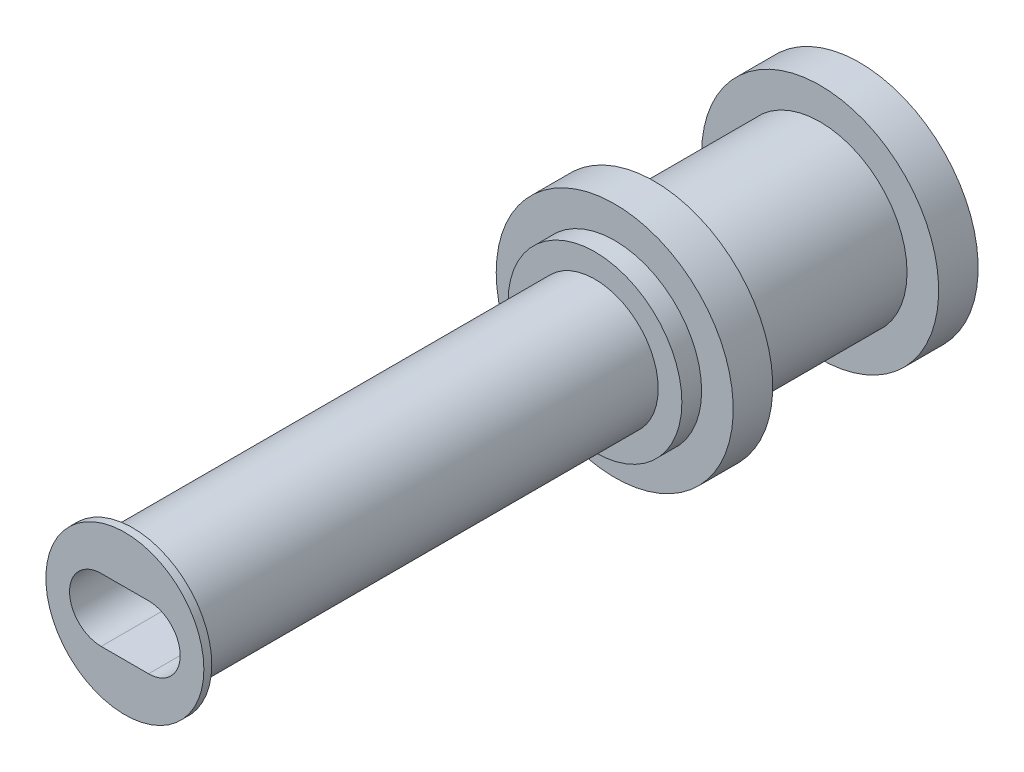
ISO-10303-21;
HEADER;
FILE_DESCRIPTION(('STEP AP214'),'2;1');
FILE_NAME('part.step','',(''),(''),'','','');
FILE_SCHEMA(('AUTOMOTIVE_DESIGN { 1 0 10303 214 1 1 1 1 }'));
ENDSEC;
DATA;
#1=APPLICATION_CONTEXT('core data for automotive mechanical design processes');
#2=APPLICATION_PROTOCOL_DEFINITION('international standard','automotive_design',2000,#1);
#3=PRODUCT_CONTEXT('',#1,'mechanical');
#4=PRODUCT('Part','Part','',(#3));
#5=PRODUCT_RELATED_PRODUCT_CATEGORY('part','',(#4));
#6=PRODUCT_DEFINITION_FORMATION('','',#4);
#7=PRODUCT_DEFINITION_CONTEXT('part definition',#1,'design');
#8=PRODUCT_DEFINITION('design','',#6,#7);
#9=PRODUCT_DEFINITION_SHAPE('','',#8);
#10=(LENGTH_UNIT() NAMED_UNIT(*) SI_UNIT(.MILLI.,.METRE.));
#11=(NAMED_UNIT(*) PLANE_ANGLE_UNIT() SI_UNIT($,.RADIAN.));
#12=(NAMED_UNIT(*) SI_UNIT($,.STERADIAN.) SOLID_ANGLE_UNIT());
#13=UNCERTAINTY_MEASURE_WITH_UNIT(LENGTH_MEASURE(1.E-05),#10,'distance_accuracy_value','');
#14=(GEOMETRIC_REPRESENTATION_CONTEXT(3) GLOBAL_UNCERTAINTY_ASSIGNED_CONTEXT((#13)) GLOBAL_UNIT_ASSIGNED_CONTEXT((#10,
#11,#12)) REPRESENTATION_CONTEXT('',''));
#15=CARTESIAN_POINT('',(0.,0.,0.));
#16=DIRECTION('',(0.,0.,1.));
#17=DIRECTION('',(1.,0.,0.));
#18=AXIS2_PLACEMENT_3D('',#15,#16,#17);
#19=CARTESIAN_POINT('',(7.874,0.,23.622));
#20=DIRECTION('',(0.,0.,-1.));
#21=DIRECTION('',(-1.,0.,0.));
#22=AXIS2_PLACEMENT_3D('',#19,#20,#21);
#23=CYLINDRICAL_SURFACE('',#22,2.032);
#24=CARTESIAN_POINT('',(7.874,0.,8.509));
#25=DIRECTION('',(0.,0.,1.));
#26=DIRECTION('',(1.,0.,0.));
#27=AXIS2_PLACEMENT_3D('',#24,#25,#26);
#28=CIRCLE('',#27,2.032);
#29=CARTESIAN_POINT('',(9.906,0.,8.509));
#30=VERTEX_POINT('',#29);
#31=EDGE_CURVE('E192',#30,#30,#28,.T.);
#32=ORIENTED_EDGE('',*,*,#31,.T.);
#33=EDGE_LOOP('',(#32));
#34=FACE_BOUND('',#33,.T.);
#35=CARTESIAN_POINT('',(7.874,0.,23.368));
#36=DIRECTION('',(0.,0.,1.));
#37=DIRECTION('',(1.,0.,0.));
#38=AXIS2_PLACEMENT_3D('',#35,#36,#37);
#39=CIRCLE('',#38,2.032);
#40=CARTESIAN_POINT('',(9.906,0.,23.368));
#41=VERTEX_POINT('',#40);
#42=EDGE_CURVE('E11',#41,#41,#39,.T.);
#43=ORIENTED_EDGE('',*,*,#42,.F.);
#44=EDGE_LOOP('',(#43));
#45=FACE_BOUND('',#44,.T.);
#46=ADVANCED_FACE('F36',(#34,#45),#23,.T.);
#47=CARTESIAN_POINT('',(7.874,0.,8.509));
#48=DIRECTION('',(0.,0.,1.));
#49=DIRECTION('',(1.,0.,0.));
#50=AXIS2_PLACEMENT_3D('',#47,#48,#49);
#51=PLANE('',#50);
#52=CARTESIAN_POINT('',(7.874,0.,8.509));
#53=DIRECTION('',(0.,0.,1.));
#54=DIRECTION('',(1.,0.,0.));
#55=AXIS2_PLACEMENT_3D('',#52,#53,#54);
#56=CIRCLE('',#55,2.794);
#57=CARTESIAN_POINT('',(10.668,0.,8.509));
#58=VERTEX_POINT('',#57);
#59=EDGE_CURVE('E197',#58,#58,#56,.T.);
#60=ORIENTED_EDGE('',*,*,#59,.T.);
#61=EDGE_LOOP('',(#60));
#62=FACE_BOUND('',#61,.T.);
#63=ORIENTED_EDGE('',*,*,#31,.F.);
#64=EDGE_LOOP('',(#63));
#65=FACE_BOUND('',#64,.T.);
#66=ADVANCED_FACE('F303',(#62,#65),#51,.T.);
#67=CARTESIAN_POINT('',(7.874,-6.28822135623731,7.874));
#68=DIRECTION('',(0.,0.,-1.));
#69=DIRECTION('',(1.,0.,0.));
#70=AXIS2_PLACEMENT_3D('',#67,#68,#69);
#71=PLANE('',#70);
#72=CARTESIAN_POINT('',(7.874,0.,7.874));
#73=DIRECTION('',(0.,0.,-1.));
#74=DIRECTION('',(-1.,0.,0.));
#75=AXIS2_PLACEMENT_3D('',#72,#73,#74);
#76=CIRCLE('',#75,3.81);
#77=CARTESIAN_POINT('',(4.064,0.,7.874));
#78=VERTEX_POINT('',#77);
#79=EDGE_CURVE('E200',#78,#78,#76,.T.);
#80=ORIENTED_EDGE('',*,*,#79,.F.);
#81=EDGE_LOOP('',(#80));
#82=FACE_BOUND('',#81,.T.);
#83=CARTESIAN_POINT('',(7.874,0.,7.874));
#84=DIRECTION('',(0.,0.,-1.));
#85=DIRECTION('',(-1.,0.,0.));
#86=AXIS2_PLACEMENT_3D('',#83,#84,#85);
#87=CIRCLE('',#86,2.794);
#88=CARTESIAN_POINT('',(5.08,0.,7.874));
#89=VERTEX_POINT('',#88);
#90=EDGE_CURVE('E44',#89,#89,#87,.F.);
#91=ORIENTED_EDGE('',*,*,#90,.F.);
#92=EDGE_LOOP('',(#91));
#93=FACE_BOUND('',#92,.T.);
#94=ADVANCED_FACE('F301',(#82,#93),#71,.F.);
#95=CARTESIAN_POINT('',(7.874,0.,3.937));
#96=DIRECTION('',(0.,0.,-1.));
#97=DIRECTION('',(-1.,0.,0.));
#98=AXIS2_PLACEMENT_3D('',#95,#96,#97);
#99=CYLINDRICAL_SURFACE('',#98,2.794);
#100=CARTESIAN_POINT('',(7.874,0.,1.27));
#101=DIRECTION('',(0.,0.,-1.));
#102=DIRECTION('',(-1.,0.,0.));
#103=AXIS2_PLACEMENT_3D('',#100,#101,#102);
#104=CIRCLE('',#103,2.794);
#105=CARTESIAN_POINT('',(5.08,0.,1.27));
#106=VERTEX_POINT('',#105);
#107=EDGE_CURVE('E291',#106,#106,#104,.T.);
#108=ORIENTED_EDGE('',*,*,#107,.F.);
#109=EDGE_LOOP('',(#108));
#110=FACE_BOUND('',#109,.T.);
#111=CARTESIAN_POINT('',(7.874,0.,6.604));
#112=DIRECTION('',(0.,0.,1.));
#113=DIRECTION('',(1.,0.,0.));
#114=AXIS2_PLACEMENT_3D('',#111,#112,#113);
#115=CIRCLE('',#114,2.794);
#116=CARTESIAN_POINT('',(10.668,0.,6.604));
#117=VERTEX_POINT('',#116);
#118=EDGE_CURVE('E294',#117,#117,#115,.T.);
#119=ORIENTED_EDGE('',*,*,#118,.F.);
#120=EDGE_LOOP('',(#119));
#121=FACE_BOUND('',#120,.T.);
#122=ADVANCED_FACE('F38',(#110,#121),#99,.T.);
#123=CARTESIAN_POINT('',(7.874,-1.524,3.937));
#124=DIRECTION('',(0.,0.,-1.));
#125=DIRECTION('',(-1.,0.,0.));
#126=AXIS2_PLACEMENT_3D('',#123,#124,#125);
#127=CYLINDRICAL_SURFACE('',#126,0.762000000000002);
#128=CARTESIAN_POINT('',(7.874,-1.524,0.));
#129=DIRECTION('',(0.,0.,1.));
#130=DIRECTION('',(1.,0.,0.));
#131=AXIS2_PLACEMENT_3D('',#128,#129,#130);
#132=CIRCLE('',#131,0.762000000000002);
#133=CARTESIAN_POINT('',(7.112,-1.524,0.));
#134=VERTEX_POINT('',#133);
#135=CARTESIAN_POINT('',(8.636,-1.524,0.));
#136=VERTEX_POINT('',#135);
#137=EDGE_CURVE('E236',#134,#136,#132,.T.);
#138=ORIENTED_EDGE('',*,*,#137,.F.);
#139=DIRECTION('',(0.,0.,-1.));
#140=VECTOR('',#139,1.);
#141=CARTESIAN_POINT('',(7.112,-1.524,3.937));
#142=LINE('',#141,#140);
#143=CARTESIAN_POINT('',(7.112,-1.524,7.874));
#144=VERTEX_POINT('',#143);
#145=EDGE_CURVE('E289',#144,#134,#142,.T.);
#146=ORIENTED_EDGE('',*,*,#145,.F.);
#147=CARTESIAN_POINT('',(7.874,-1.524,7.874));
#148=DIRECTION('',(0.,0.,1.));
#149=DIRECTION('',(1.,0.,0.));
#150=AXIS2_PLACEMENT_3D('',#147,#148,#149);
#151=CIRCLE('',#150,0.762000000000002);
#152=CARTESIAN_POINT('',(8.636,-1.524,7.874));
#153=VERTEX_POINT('',#152);
#154=EDGE_CURVE('E204',#144,#153,#151,.T.);
#155=ORIENTED_EDGE('',*,*,#154,.T.);
#156=DIRECTION('',(0.,0.,-1.));
#157=VECTOR('',#156,1.);
#158=CARTESIAN_POINT('',(8.636,-1.524,3.937));
#159=LINE('',#158,#157);
#160=EDGE_CURVE('E59',#153,#136,#159,.T.);
#161=ORIENTED_EDGE('',*,*,#160,.T.);
#162=EDGE_LOOP('',(#138,#146,#155,#161));
#163=FACE_BOUND('',#162,.T.);
#164=ADVANCED_FACE('F310',(#163),#127,.F.);
#165=CARTESIAN_POINT('',(7.112,-6.28822135623731,3.937));
#166=DIRECTION('',(1.,0.,0.));
#167=DIRECTION('',(0.,0.,-1.));
#168=AXIS2_PLACEMENT_3D('',#165,#166,#167);
#169=PLANE('',#168);
#170=DIRECTION('',(0.,-1.,0.));
#171=VECTOR('',#170,1.);
#172=CARTESIAN_POINT('',(7.112,-6.28822135623731,0.));
#173=LINE('',#172,#171);
#174=CARTESIAN_POINT('',(7.112,-0.762000000000001,0.));
#175=VERTEX_POINT('',#174);
#176=EDGE_CURVE('E242',#175,#134,#173,.T.);
#177=ORIENTED_EDGE('',*,*,#176,.F.);
#178=DIRECTION('',(0.,0.,-1.));
#179=VECTOR('',#178,1.);
#180=CARTESIAN_POINT('',(7.112,-0.762000000000001,3.937));
#181=LINE('',#180,#179);
#182=CARTESIAN_POINT('',(7.112,-0.762000000000001,7.874));
#183=VERTEX_POINT('',#182);
#184=EDGE_CURVE('E287',#183,#175,#181,.T.);
#185=ORIENTED_EDGE('',*,*,#184,.F.);
#186=DIRECTION('',(0.,-1.,0.));
#187=VECTOR('',#186,1.);
#188=CARTESIAN_POINT('',(7.112,-6.28822135623731,7.874));
#189=LINE('',#188,#187);
#190=EDGE_CURVE('E229',#183,#144,#189,.T.);
#191=ORIENTED_EDGE('',*,*,#190,.T.);
#192=ORIENTED_EDGE('',*,*,#145,.T.);
#193=EDGE_LOOP('',(#177,#185,#191,#192));
#194=FACE_BOUND('',#193,.T.);
#195=ADVANCED_FACE('F466',(#194),#169,.T.);
#196=CARTESIAN_POINT('',(7.874,-0.762000000000001,3.937));
#197=DIRECTION('',(0.,1.,0.));
#198=DIRECTION('',(-1.,0.,0.));
#199=AXIS2_PLACEMENT_3D('',#196,#197,#198);
#200=PLANE('',#199);
#201=DIRECTION('',(1.,0.,0.));
#202=VECTOR('',#201,1.);
#203=CARTESIAN_POINT('',(7.874,-0.762000000000001,0.));
#204=LINE('',#203,#202);
#205=CARTESIAN_POINT('',(6.35,-0.762000000000002,0.));
#206=VERTEX_POINT('',#205);
#207=EDGE_CURVE('E245',#206,#175,#204,.T.);
#208=ORIENTED_EDGE('',*,*,#207,.F.);
#209=DIRECTION('',(0.,0.,-1.));
#210=VECTOR('',#209,1.);
#211=CARTESIAN_POINT('',(6.35,-0.762000000000002,3.937));
#212=LINE('',#211,#210);
#213=CARTESIAN_POINT('',(6.35,-0.762000000000002,7.874));
#214=VERTEX_POINT('',#213);
#215=EDGE_CURVE('E285',#214,#206,#212,.T.);
#216=ORIENTED_EDGE('',*,*,#215,.F.);
#217=DIRECTION('',(1.,0.,0.));
#218=VECTOR('',#217,1.);
#219=CARTESIAN_POINT('',(7.874,-0.762000000000001,7.874));
#220=LINE('',#219,#218);
#221=EDGE_CURVE('E216',#214,#183,#220,.T.);
#222=ORIENTED_EDGE('',*,*,#221,.T.);
#223=ORIENTED_EDGE('',*,*,#184,.T.);
#224=EDGE_LOOP('',(#208,#216,#222,#223));
#225=FACE_BOUND('',#224,.T.);
#226=ADVANCED_FACE('F476',(#225),#200,.T.);
#227=CARTESIAN_POINT('',(6.35,0.,3.937));
#228=DIRECTION('',(0.,0.,-1.));
#229=DIRECTION('',(-1.,0.,0.));
#230=AXIS2_PLACEMENT_3D('',#227,#228,#229);
#231=CYLINDRICAL_SURFACE('',#230,0.762000000000002);
#232=CARTESIAN_POINT('',(6.35,0.,0.));
#233=DIRECTION('',(0.,0.,1.));
#234=DIRECTION('',(1.,0.,0.));
#235=AXIS2_PLACEMENT_3D('',#232,#233,#234);
#236=CIRCLE('',#235,0.762000000000002);
#237=CARTESIAN_POINT('',(6.35,0.762000000000001,0.));
#238=VERTEX_POINT('',#237);
#239=EDGE_CURVE('E249',#238,#206,#236,.T.);
#240=ORIENTED_EDGE('',*,*,#239,.F.);
#241=DIRECTION('',(0.,0.,-1.));
#242=VECTOR('',#241,1.);
#243=CARTESIAN_POINT('',(6.35,0.762000000000001,3.937));
#244=LINE('',#243,#242);
#245=CARTESIAN_POINT('',(6.35,0.762000000000001,7.874));
#246=VERTEX_POINT('',#245);
#247=EDGE_CURVE('E283',#246,#238,#244,.T.);
#248=ORIENTED_EDGE('',*,*,#247,.F.);
#249=CARTESIAN_POINT('',(6.35,0.,7.874));
#250=DIRECTION('',(0.,0.,1.));
#251=DIRECTION('',(1.,0.,0.));
#252=AXIS2_PLACEMENT_3D('',#249,#250,#251);
#253=CIRCLE('',#252,0.762000000000002);
#254=EDGE_CURVE('E230',#246,#214,#253,.T.);
#255=ORIENTED_EDGE('',*,*,#254,.T.);
#256=ORIENTED_EDGE('',*,*,#215,.T.);
#257=EDGE_LOOP('',(#240,#248,#255,#256));
#258=FACE_BOUND('',#257,.T.);
#259=ADVANCED_FACE('F488',(#258),#231,.F.);
#260=CARTESIAN_POINT('',(7.874,0.762000000000001,3.937));
#261=DIRECTION('',(0.,1.,0.));
#262=DIRECTION('',(-1.,0.,0.));
#263=AXIS2_PLACEMENT_3D('',#260,#261,#262);
#264=PLANE('',#263);
#265=DIRECTION('',(1.,0.,0.));
#266=VECTOR('',#265,1.);
#267=CARTESIAN_POINT('',(7.874,0.762000000000001,0.));
#268=LINE('',#267,#266);
#269=CARTESIAN_POINT('',(7.112,0.762000000000001,0.));
#270=VERTEX_POINT('',#269);
#271=EDGE_CURVE('E253',#238,#270,#268,.T.);
#272=ORIENTED_EDGE('',*,*,#271,.T.);
#273=DIRECTION('',(0.,0.,-1.));
#274=VECTOR('',#273,1.);
#275=CARTESIAN_POINT('',(7.112,0.762000000000001,3.937));
#276=LINE('',#275,#274);
#277=CARTESIAN_POINT('',(7.112,0.762000000000001,7.874));
#278=VERTEX_POINT('',#277);
#279=EDGE_CURVE('E281',#278,#270,#276,.T.);
#280=ORIENTED_EDGE('',*,*,#279,.F.);
#281=DIRECTION('',(1.,0.,0.));
#282=VECTOR('',#281,1.);
#283=CARTESIAN_POINT('',(7.874,0.762000000000001,7.874));
#284=LINE('',#283,#282);
#285=EDGE_CURVE('E222',#246,#278,#284,.T.);
#286=ORIENTED_EDGE('',*,*,#285,.F.);
#287=ORIENTED_EDGE('',*,*,#247,.T.);
#288=EDGE_LOOP('',(#272,#280,#286,#287));
#289=FACE_BOUND('',#288,.T.);
#290=ADVANCED_FACE('F500',(#289),#264,.F.);
#291=CARTESIAN_POINT('',(7.112,1.524,0.));
#292=VERTEX_POINT('',#291);
#293=EDGE_CURVE('E246',#292,#270,#173,.T.);
#294=ORIENTED_EDGE('',*,*,#293,.F.);
#295=DIRECTION('',(0.,0.,-1.));
#296=VECTOR('',#295,1.);
#297=CARTESIAN_POINT('',(7.112,1.524,3.937));
#298=LINE('',#297,#296);
#299=CARTESIAN_POINT('',(7.112,1.524,7.874));
#300=VERTEX_POINT('',#299);
#301=EDGE_CURVE('E279',#300,#292,#298,.T.);
#302=ORIENTED_EDGE('',*,*,#301,.F.);
#303=EDGE_CURVE('E226',#300,#278,#189,.T.);
#304=ORIENTED_EDGE('',*,*,#303,.T.);
#305=ORIENTED_EDGE('',*,*,#279,.T.);
#306=EDGE_LOOP('',(#294,#302,#304,#305));
#307=FACE_BOUND('',#306,.T.);
#308=ADVANCED_FACE('F479',(#307),#169,.T.);
#309=CARTESIAN_POINT('',(7.874,1.524,3.937));
#310=DIRECTION('',(0.,0.,-1.));
#311=DIRECTION('',(-1.,0.,0.));
#312=AXIS2_PLACEMENT_3D('',#309,#310,#311);
#313=CYLINDRICAL_SURFACE('',#312,0.762000000000002);
#314=CARTESIAN_POINT('',(7.874,1.524,0.));
#315=DIRECTION('',(0.,0.,1.));
#316=DIRECTION('',(1.,0.,0.));
#317=AXIS2_PLACEMENT_3D('',#314,#315,#316);
#318=CIRCLE('',#317,0.762000000000002);
#319=CARTESIAN_POINT('',(8.636,1.524,0.));
#320=VERTEX_POINT('',#319);
#321=EDGE_CURVE('E257',#320,#292,#318,.T.);
#322=ORIENTED_EDGE('',*,*,#321,.F.);
#323=DIRECTION('',(0.,0.,-1.));
#324=VECTOR('',#323,1.);
#325=CARTESIAN_POINT('',(8.636,1.524,3.937));
#326=LINE('',#325,#324);
#327=CARTESIAN_POINT('',(8.636,1.524,7.874));
#328=VERTEX_POINT('',#327);
#329=EDGE_CURVE('E277',#328,#320,#326,.T.);
#330=ORIENTED_EDGE('',*,*,#329,.F.);
#331=CARTESIAN_POINT('',(7.874,1.524,7.874));
#332=DIRECTION('',(0.,0.,1.));
#333=DIRECTION('',(1.,0.,0.));
#334=AXIS2_PLACEMENT_3D('',#331,#332,#333);
#335=CIRCLE('',#334,0.762000000000002);
#336=EDGE_CURVE('E223',#328,#300,#335,.T.);
#337=ORIENTED_EDGE('',*,*,#336,.T.);
#338=ORIENTED_EDGE('',*,*,#301,.T.);
#339=EDGE_LOOP('',(#322,#330,#337,#338));
#340=FACE_BOUND('',#339,.T.);
#341=ADVANCED_FACE('F522',(#340),#313,.F.);
#342=CARTESIAN_POINT('',(8.636,-6.28822135623731,3.937));
#343=DIRECTION('',(1.,0.,0.));
#344=DIRECTION('',(0.,0.,-1.));
#345=AXIS2_PLACEMENT_3D('',#342,#343,#344);
#346=PLANE('',#345);
#347=DIRECTION('',(0.,-1.,0.));
#348=VECTOR('',#347,1.);
#349=CARTESIAN_POINT('',(8.636,-6.28822135623731,0.));
#350=LINE('',#349,#348);
#351=CARTESIAN_POINT('',(8.636,0.762000000000001,0.));
#352=VERTEX_POINT('',#351);
#353=EDGE_CURVE('E260',#320,#352,#350,.T.);
#354=ORIENTED_EDGE('',*,*,#353,.T.);
#355=DIRECTION('',(0.,0.,-1.));
#356=VECTOR('',#355,1.);
#357=CARTESIAN_POINT('',(8.636,0.762000000000001,3.937));
#358=LINE('',#357,#356);
#359=CARTESIAN_POINT('',(8.636,0.762000000000001,7.874));
#360=VERTEX_POINT('',#359);
#361=EDGE_CURVE('E274',#360,#352,#358,.T.);
#362=ORIENTED_EDGE('',*,*,#361,.F.);
#363=DIRECTION('',(0.,-1.,0.));
#364=VECTOR('',#363,1.);
#365=CARTESIAN_POINT('',(8.636,-6.28822135623731,7.874));
#366=LINE('',#365,#364);
#367=EDGE_CURVE('E212',#328,#360,#366,.T.);
#368=ORIENTED_EDGE('',*,*,#367,.F.);
#369=ORIENTED_EDGE('',*,*,#329,.T.);
#370=EDGE_LOOP('',(#354,#362,#368,#369));
#371=FACE_BOUND('',#370,.T.);
#372=ADVANCED_FACE('F532',(#371),#346,.F.);
#373=CARTESIAN_POINT('',(9.398,0.762000000000002,0.));
#374=VERTEX_POINT('',#373);
#375=EDGE_CURVE('E256',#352,#374,#268,.T.);
#376=ORIENTED_EDGE('',*,*,#375,.T.);
#377=DIRECTION('',(0.,0.,-1.));
#378=VECTOR('',#377,1.);
#379=CARTESIAN_POINT('',(9.398,0.762000000000002,3.937));
#380=LINE('',#379,#378);
#381=CARTESIAN_POINT('',(9.398,0.762000000000002,7.874));
#382=VERTEX_POINT('',#381);
#383=EDGE_CURVE('E272',#382,#374,#380,.T.);
#384=ORIENTED_EDGE('',*,*,#383,.F.);
#385=EDGE_CURVE('E219',#360,#382,#284,.T.);
#386=ORIENTED_EDGE('',*,*,#385,.F.);
#387=ORIENTED_EDGE('',*,*,#361,.T.);
#388=EDGE_LOOP('',(#376,#384,#386,#387));
#389=FACE_BOUND('',#388,.T.);
#390=ADVANCED_FACE('F513',(#389),#264,.F.);
#391=CARTESIAN_POINT('',(9.398,0.,3.937));
#392=DIRECTION('',(0.,0.,-1.));
#393=DIRECTION('',(-1.,0.,0.));
#394=AXIS2_PLACEMENT_3D('',#391,#392,#393);
#395=CYLINDRICAL_SURFACE('',#394,0.762000000000002);
#396=CARTESIAN_POINT('',(9.398,0.,0.));
#397=DIRECTION('',(0.,0.,1.));
#398=DIRECTION('',(1.,0.,0.));
#399=AXIS2_PLACEMENT_3D('',#396,#397,#398);
#400=CIRCLE('',#399,0.762000000000002);
#401=CARTESIAN_POINT('',(9.398,-0.762000000000001,0.));
#402=VERTEX_POINT('',#401);
#403=EDGE_CURVE('E264',#402,#374,#400,.T.);
#404=ORIENTED_EDGE('',*,*,#403,.F.);
#405=DIRECTION('',(0.,0.,-1.));
#406=VECTOR('',#405,1.);
#407=CARTESIAN_POINT('',(9.398,-0.762000000000001,3.937));
#408=LINE('',#407,#406);
#409=CARTESIAN_POINT('',(9.398,-0.762000000000001,7.874));
#410=VERTEX_POINT('',#409);
#411=EDGE_CURVE('E270',#410,#402,#408,.T.);
#412=ORIENTED_EDGE('',*,*,#411,.F.);
#413=CARTESIAN_POINT('',(9.398,0.,7.874));
#414=DIRECTION('',(0.,0.,1.));
#415=DIRECTION('',(1.,0.,0.));
#416=AXIS2_PLACEMENT_3D('',#413,#414,#415);
#417=CIRCLE('',#416,0.762000000000002);
#418=EDGE_CURVE('E215',#410,#382,#417,.T.);
#419=ORIENTED_EDGE('',*,*,#418,.T.);
#420=ORIENTED_EDGE('',*,*,#383,.T.);
#421=EDGE_LOOP('',(#404,#412,#419,#420));
#422=FACE_BOUND('',#421,.T.);
#423=ADVANCED_FACE('F554',(#422),#395,.F.);
#424=CARTESIAN_POINT('',(8.636,-0.762000000000001,0.));
#425=VERTEX_POINT('',#424);
#426=EDGE_CURVE('E250',#425,#402,#204,.T.);
#427=ORIENTED_EDGE('',*,*,#426,.F.);
#428=DIRECTION('',(0.,0.,-1.));
#429=VECTOR('',#428,1.);
#430=CARTESIAN_POINT('',(8.636,-0.762000000000001,3.937));
#431=LINE('',#430,#429);
#432=CARTESIAN_POINT('',(8.636,-0.762000000000001,7.874));
#433=VERTEX_POINT('',#432);
#434=EDGE_CURVE('E268',#433,#425,#431,.T.);
#435=ORIENTED_EDGE('',*,*,#434,.F.);
#436=EDGE_CURVE('E211',#433,#410,#220,.T.);
#437=ORIENTED_EDGE('',*,*,#436,.T.);
#438=ORIENTED_EDGE('',*,*,#411,.T.);
#439=EDGE_LOOP('',(#427,#435,#437,#438));
#440=FACE_BOUND('',#439,.T.);
#441=ADVANCED_FACE('F491',(#440),#200,.T.);
#442=EDGE_CURVE('E263',#425,#136,#350,.T.);
#443=ORIENTED_EDGE('',*,*,#442,.T.);
#444=ORIENTED_EDGE('',*,*,#160,.F.);
#445=EDGE_CURVE('E208',#433,#153,#366,.T.);
#446=ORIENTED_EDGE('',*,*,#445,.F.);
#447=ORIENTED_EDGE('',*,*,#434,.T.);
#448=EDGE_LOOP('',(#443,#444,#446,#447));
#449=FACE_BOUND('',#448,.T.);
#450=ADVANCED_FACE('F545',(#449),#346,.F.);
#451=CARTESIAN_POINT('',(7.874,-6.28822135623731,0.));
#452=DIRECTION('',(0.,0.,1.));
#453=DIRECTION('',(1.,0.,0.));
#454=AXIS2_PLACEMENT_3D('',#451,#452,#453);
#455=PLANE('',#454);
#456=ORIENTED_EDGE('',*,*,#137,.T.);
#457=ORIENTED_EDGE('',*,*,#442,.F.);
#458=ORIENTED_EDGE('',*,*,#426,.T.);
#459=ORIENTED_EDGE('',*,*,#403,.T.);
#460=ORIENTED_EDGE('',*,*,#375,.F.);
#461=ORIENTED_EDGE('',*,*,#353,.F.);
#462=ORIENTED_EDGE('',*,*,#321,.T.);
#463=ORIENTED_EDGE('',*,*,#293,.T.);
#464=ORIENTED_EDGE('',*,*,#271,.F.);
#465=ORIENTED_EDGE('',*,*,#239,.T.);
#466=ORIENTED_EDGE('',*,*,#207,.T.);
#467=ORIENTED_EDGE('',*,*,#176,.T.);
#468=EDGE_LOOP('',(#456,#457,#458,#459,#460,#461,#462,#463,#464,#465,#466,#467));
#469=FACE_BOUND('',#468,.T.);
#470=CARTESIAN_POINT('',(7.874,0.,0.));
#471=DIRECTION('',(0.,0.,-1.));
#472=DIRECTION('',(-1.,0.,0.));
#473=AXIS2_PLACEMENT_3D('',#470,#471,#472);
#474=CIRCLE('',#473,3.81);
#475=CARTESIAN_POINT('',(4.064,0.,0.));
#476=VERTEX_POINT('',#475);
#477=EDGE_CURVE('E237',#476,#476,#474,.T.);
#478=ORIENTED_EDGE('',*,*,#477,.T.);
#479=EDGE_LOOP('',(#478));
#480=FACE_BOUND('',#479,.T.);
#481=ADVANCED_FACE('F581',(#469,#480),#455,.F.);
#482=CARTESIAN_POINT('',(7.874,0.,1.27));
#483=DIRECTION('',(0.,0.,-1.));
#484=DIRECTION('',(-1.,0.,0.));
#485=AXIS2_PLACEMENT_3D('',#482,#483,#484);
#486=CYLINDRICAL_SURFACE('',#485,3.81);
#487=CARTESIAN_POINT('',(7.874,0.,1.27));
#488=DIRECTION('',(0.,0.,-1.));
#489=DIRECTION('',(-1.,0.,0.));
#490=AXIS2_PLACEMENT_3D('',#487,#488,#489);
#491=CIRCLE('',#490,3.81);
#492=CARTESIAN_POINT('',(4.064,0.,1.27));
#493=VERTEX_POINT('',#492);
#494=EDGE_CURVE('E233',#493,#493,#491,.T.);
#495=ORIENTED_EDGE('',*,*,#494,.T.);
#496=EDGE_LOOP('',(#495));
#497=FACE_BOUND('',#496,.T.);
#498=ORIENTED_EDGE('',*,*,#477,.F.);
#499=EDGE_LOOP('',(#498));
#500=FACE_BOUND('',#499,.T.);
#501=ADVANCED_FACE('F592',(#497,#500),#486,.T.);
#502=CARTESIAN_POINT('',(7.874,0.,1.27));
#503=DIRECTION('',(0.,0.,-1.));
#504=DIRECTION('',(-1.,0.,0.));
#505=AXIS2_PLACEMENT_3D('',#502,#503,#504);
#506=PLANE('',#505);
#507=ORIENTED_EDGE('',*,*,#107,.T.);
#508=EDGE_LOOP('',(#507));
#509=FACE_BOUND('',#508,.T.);
#510=ORIENTED_EDGE('',*,*,#494,.F.);
#511=EDGE_LOOP('',(#510));
#512=FACE_BOUND('',#511,.T.);
#513=ADVANCED_FACE('F338',(#509,#512),#506,.F.);
#514=CARTESIAN_POINT('',(7.874,0.,6.604));
#515=DIRECTION('',(0.,0.,1.));
#516=DIRECTION('',(-1.,0.,0.));
#517=AXIS2_PLACEMENT_3D('',#514,#515,#516);
#518=PLANE('',#517);
#519=CARTESIAN_POINT('',(7.874,0.,6.604));
#520=DIRECTION('',(0.,0.,-1.));
#521=DIRECTION('',(-1.,0.,0.));
#522=AXIS2_PLACEMENT_3D('',#519,#520,#521);
#523=CIRCLE('',#522,3.81);
#524=CARTESIAN_POINT('',(4.064,0.,6.604));
#525=VERTEX_POINT('',#524);
#526=EDGE_CURVE('E201',#525,#525,#523,.T.);
#527=ORIENTED_EDGE('',*,*,#526,.T.);
#528=EDGE_LOOP('',(#527));
#529=FACE_BOUND('',#528,.T.);
#530=ORIENTED_EDGE('',*,*,#118,.T.);
#531=EDGE_LOOP('',(#530));
#532=FACE_BOUND('',#531,.T.);
#533=ADVANCED_FACE('F336',(#529,#532),#518,.F.);
#534=CARTESIAN_POINT('',(7.874,0.,6.604));
#535=DIRECTION('',(0.,0.,1.));
#536=DIRECTION('',(1.,0.,0.));
#537=AXIS2_PLACEMENT_3D('',#534,#535,#536);
#538=CYLINDRICAL_SURFACE('',#537,3.81);
#539=ORIENTED_EDGE('',*,*,#526,.F.);
#540=EDGE_LOOP('',(#539));
#541=FACE_BOUND('',#540,.T.);
#542=ORIENTED_EDGE('',*,*,#79,.T.);
#543=EDGE_LOOP('',(#542));
#544=FACE_BOUND('',#543,.T.);
#545=ADVANCED_FACE('F334',(#541,#544),#538,.T.);
#546=CARTESIAN_POINT('',(7.874,0.,8.509));
#547=DIRECTION('',(0.,0.,-1.));
#548=DIRECTION('',(-1.,0.,0.));
#549=AXIS2_PLACEMENT_3D('',#546,#547,#548);
#550=CYLINDRICAL_SURFACE('',#549,2.794);
#551=ORIENTED_EDGE('',*,*,#59,.F.);
#552=EDGE_LOOP('',(#551));
#553=FACE_BOUND('',#552,.T.);
#554=ORIENTED_EDGE('',*,*,#90,.T.);
#555=EDGE_LOOP('',(#554));
#556=FACE_BOUND('',#555,.T.);
#557=ADVANCED_FACE('F299',(#553,#556),#550,.T.);
#558=CARTESIAN_POINT('',(7.874,0.,7.874));
#559=DIRECTION('',(0.,0.,1.));
#560=DIRECTION('',(1.,0.,0.));
#561=AXIS2_PLACEMENT_3D('',#558,#559,#560);
#562=PLANE('',#561);
#563=ORIENTED_EDGE('',*,*,#154,.F.);
#564=ORIENTED_EDGE('',*,*,#190,.F.);
#565=ORIENTED_EDGE('',*,*,#221,.F.);
#566=ORIENTED_EDGE('',*,*,#254,.F.);
#567=ORIENTED_EDGE('',*,*,#285,.T.);
#568=ORIENTED_EDGE('',*,*,#303,.F.);
#569=ORIENTED_EDGE('',*,*,#336,.F.);
#570=ORIENTED_EDGE('',*,*,#367,.T.);
#571=ORIENTED_EDGE('',*,*,#385,.T.);
#572=ORIENTED_EDGE('',*,*,#418,.F.);
#573=ORIENTED_EDGE('',*,*,#436,.F.);
#574=ORIENTED_EDGE('',*,*,#445,.T.);
#575=EDGE_LOOP('',(#563,#564,#565,#566,#567,#568,#569,#570,#571,#572,#573,#574));
#576=FACE_BOUND('',#575,.T.);
#577=ADVANCED_FACE('F327',(#576),#562,.F.);
#578=CARTESIAN_POINT('',(7.874,0.,23.368));
#579=DIRECTION('',(0.,0.,1.));
#580=DIRECTION('',(1.,0.,0.));
#581=AXIS2_PLACEMENT_3D('',#578,#579,#580);
#582=CYLINDRICAL_SURFACE('',#581,2.54);
#583=CARTESIAN_POINT('',(7.874,0.,23.368));
#584=DIRECTION('',(0.,0.,1.));
#585=DIRECTION('',(1.,0.,0.));
#586=AXIS2_PLACEMENT_3D('',#583,#584,#585);
#587=CIRCLE('',#586,2.54);
#588=CARTESIAN_POINT('',(10.414,0.,23.368));
#589=VERTEX_POINT('',#588);
#590=EDGE_CURVE('E189',#589,#589,#587,.T.);
#591=ORIENTED_EDGE('',*,*,#590,.T.);
#592=EDGE_LOOP('',(#591));
#593=FACE_BOUND('',#592,.T.);
#594=CARTESIAN_POINT('',(7.874,0.,23.622));
#595=DIRECTION('',(0.,0.,1.));
#596=DIRECTION('',(1.,0.,0.));
#597=AXIS2_PLACEMENT_3D('',#594,#595,#596);
#598=CIRCLE('',#597,2.54);
#599=CARTESIAN_POINT('',(10.414,0.,23.622));
#600=VERTEX_POINT('',#599);
#601=EDGE_CURVE('E185',#600,#600,#598,.T.);
#602=ORIENTED_EDGE('',*,*,#601,.F.);
#603=EDGE_LOOP('',(#602));
#604=FACE_BOUND('',#603,.T.);
#605=ADVANCED_FACE('F330',(#593,#604),#582,.T.);
#606=CARTESIAN_POINT('',(7.874,0.,23.368));
#607=DIRECTION('',(0.,0.,1.));
#608=DIRECTION('',(1.,0.,0.));
#609=AXIS2_PLACEMENT_3D('',#606,#607,#608);
#610=PLANE('',#609);
#611=ORIENTED_EDGE('',*,*,#42,.T.);
#612=EDGE_LOOP('',(#611));
#613=FACE_BOUND('',#612,.T.);
#614=ORIENTED_EDGE('',*,*,#590,.F.);
#615=EDGE_LOOP('',(#614));
#616=FACE_BOUND('',#615,.T.);
#617=ADVANCED_FACE('F368',(#613,#616),#610,.F.);
#618=CARTESIAN_POINT('',(7.874,0.,23.622));
#619=DIRECTION('',(0.,0.,1.));
#620=DIRECTION('',(1.,0.,0.));
#621=AXIS2_PLACEMENT_3D('',#618,#619,#620);
#622=PLANE('',#621);
#623=CARTESIAN_POINT('',(8.636,0.,23.622));
#624=DIRECTION('',(0.,0.,1.));
#625=DIRECTION('',(1.,0.,0.));
#626=AXIS2_PLACEMENT_3D('',#623,#624,#625);
#627=CIRCLE('',#626,1.016);
#628=CARTESIAN_POINT('',(8.636,-1.016,23.622));
#629=VERTEX_POINT('',#628);
#630=CARTESIAN_POINT('',(8.636,1.016,23.622));
#631=VERTEX_POINT('',#630);
#632=EDGE_CURVE('E51',#629,#631,#627,.T.);
#633=ORIENTED_EDGE('',*,*,#632,.F.);
#634=DIRECTION('',(1.,0.,0.));
#635=VECTOR('',#634,1.);
#636=CARTESIAN_POINT('',(8.636,-1.016,23.622));
#637=LINE('',#636,#635);
#638=CARTESIAN_POINT('',(7.112,-1.016,23.622));
#639=VERTEX_POINT('',#638);
#640=EDGE_CURVE('E170',#639,#629,#637,.T.);
#641=ORIENTED_EDGE('',*,*,#640,.F.);
#642=CARTESIAN_POINT('',(7.112,0.,23.622));
#643=DIRECTION('',(0.,0.,1.));
#644=DIRECTION('',(1.,0.,0.));
#645=AXIS2_PLACEMENT_3D('',#642,#643,#644);
#646=CIRCLE('',#645,1.016);
#647=CARTESIAN_POINT('',(7.112,1.016,23.622));
#648=VERTEX_POINT('',#647);
#649=EDGE_CURVE('E173',#648,#639,#646,.T.);
#650=ORIENTED_EDGE('',*,*,#649,.F.);
#651=DIRECTION('',(-1.,0.,0.));
#652=VECTOR('',#651,1.);
#653=CARTESIAN_POINT('',(8.636,1.016,23.622));
#654=LINE('',#653,#652);
#655=EDGE_CURVE('E179',#631,#648,#654,.T.);
#656=ORIENTED_EDGE('',*,*,#655,.F.);
#657=EDGE_LOOP('',(#633,#641,#650,#656));
#658=FACE_BOUND('',#657,.T.);
#659=ORIENTED_EDGE('',*,*,#601,.T.);
#660=EDGE_LOOP('',(#659));
#661=FACE_BOUND('',#660,.T.);
#662=ADVANCED_FACE('F324',(#658,#661),#622,.T.);
#663=CARTESIAN_POINT('',(8.636,0.,8.382));
#664=DIRECTION('',(0.,0.,1.));
#665=DIRECTION('',(1.,0.,0.));
#666=AXIS2_PLACEMENT_3D('',#663,#664,#665);
#667=CYLINDRICAL_SURFACE('',#666,1.016);
#668=ORIENTED_EDGE('',*,*,#632,.T.);
#669=DIRECTION('',(0.,0.,1.));
#670=VECTOR('',#669,1.);
#671=CARTESIAN_POINT('',(8.636,1.016,8.382));
#672=LINE('',#671,#670);
#673=CARTESIAN_POINT('',(8.636,1.016,8.382));
#674=VERTEX_POINT('',#673);
#675=EDGE_CURVE('E148',#674,#631,#672,.T.);
#676=ORIENTED_EDGE('',*,*,#675,.F.);
#677=CARTESIAN_POINT('',(8.636,0.,8.382));
#678=DIRECTION('',(0.,0.,1.));
#679=DIRECTION('',(1.,0.,0.));
#680=AXIS2_PLACEMENT_3D('',#677,#678,#679);
#681=CIRCLE('',#680,1.016);
#682=CARTESIAN_POINT('',(8.636,-1.016,8.382));
#683=VERTEX_POINT('',#682);
#684=EDGE_CURVE('E152',#683,#674,#681,.T.);
#685=ORIENTED_EDGE('',*,*,#684,.F.);
#686=DIRECTION('',(0.,0.,1.));
#687=VECTOR('',#686,1.);
#688=CARTESIAN_POINT('',(8.636,-1.016,8.382));
#689=LINE('',#688,#687);
#690=EDGE_CURVE('E183',#683,#629,#689,.T.);
#691=ORIENTED_EDGE('',*,*,#690,.T.);
#692=EDGE_LOOP('',(#668,#676,#685,#691));
#693=FACE_BOUND('',#692,.T.);
#694=ADVANCED_FACE('F150',(#693),#667,.F.);
#695=CARTESIAN_POINT('',(8.636,-1.016,8.382));
#696=DIRECTION('',(0.,-1.,0.));
#697=DIRECTION('',(1.,0.,0.));
#698=AXIS2_PLACEMENT_3D('',#695,#696,#697);
#699=PLANE('',#698);
#700=ORIENTED_EDGE('',*,*,#640,.T.);
#701=ORIENTED_EDGE('',*,*,#690,.F.);
#702=DIRECTION('',(1.,0.,0.));
#703=VECTOR('',#702,1.);
#704=CARTESIAN_POINT('',(8.636,-1.016,8.382));
#705=LINE('',#704,#703);
#706=CARTESIAN_POINT('',(7.112,-1.016,8.382));
#707=VERTEX_POINT('',#706);
#708=EDGE_CURVE('E158',#707,#683,#705,.T.);
#709=ORIENTED_EDGE('',*,*,#708,.F.);
#710=DIRECTION('',(0.,0.,1.));
#711=VECTOR('',#710,1.);
#712=CARTESIAN_POINT('',(7.112,-1.016,8.382));
#713=LINE('',#712,#711);
#714=EDGE_CURVE('E186',#707,#639,#713,.T.);
#715=ORIENTED_EDGE('',*,*,#714,.T.);
#716=EDGE_LOOP('',(#700,#701,#709,#715));
#717=FACE_BOUND('',#716,.T.);
#718=ADVANCED_FACE('F388',(#717),#699,.F.);
#719=CARTESIAN_POINT('',(7.112,0.,8.382));
#720=DIRECTION('',(0.,0.,1.));
#721=DIRECTION('',(1.,0.,0.));
#722=AXIS2_PLACEMENT_3D('',#719,#720,#721);
#723=CYLINDRICAL_SURFACE('',#722,1.016);
#724=ORIENTED_EDGE('',*,*,#649,.T.);
#725=ORIENTED_EDGE('',*,*,#714,.F.);
#726=CARTESIAN_POINT('',(7.112,0.,8.382));
#727=DIRECTION('',(0.,0.,1.));
#728=DIRECTION('',(1.,0.,0.));
#729=AXIS2_PLACEMENT_3D('',#726,#727,#728);
#730=CIRCLE('',#729,1.016);
#731=CARTESIAN_POINT('',(7.112,1.016,8.382));
#732=VERTEX_POINT('',#731);
#733=EDGE_CURVE('E166',#732,#707,#730,.T.);
#734=ORIENTED_EDGE('',*,*,#733,.F.);
#735=DIRECTION('',(0.,0.,1.));
#736=VECTOR('',#735,1.);
#737=CARTESIAN_POINT('',(7.112,1.016,8.382));
#738=LINE('',#737,#736);
#739=EDGE_CURVE('E157',#732,#648,#738,.T.);
#740=ORIENTED_EDGE('',*,*,#739,.T.);
#741=EDGE_LOOP('',(#724,#725,#734,#740));
#742=FACE_BOUND('',#741,.T.);
#743=ADVANCED_FACE('F395',(#742),#723,.F.);
#744=CARTESIAN_POINT('',(8.636,1.016,8.382));
#745=DIRECTION('',(0.,1.,0.));
#746=DIRECTION('',(-1.,0.,0.));
#747=AXIS2_PLACEMENT_3D('',#744,#745,#746);
#748=PLANE('',#747);
#749=ORIENTED_EDGE('',*,*,#655,.T.);
#750=ORIENTED_EDGE('',*,*,#739,.F.);
#751=DIRECTION('',(-1.,0.,0.));
#752=VECTOR('',#751,1.);
#753=CARTESIAN_POINT('',(8.636,1.016,8.382));
#754=LINE('',#753,#752);
#755=EDGE_CURVE('E161',#674,#732,#754,.T.);
#756=ORIENTED_EDGE('',*,*,#755,.F.);
#757=ORIENTED_EDGE('',*,*,#675,.T.);
#758=EDGE_LOOP('',(#749,#750,#756,#757));
#759=FACE_BOUND('',#758,.T.);
#760=ADVANCED_FACE('F162',(#759),#748,.F.);
#761=CARTESIAN_POINT('',(8.636,0.,8.382));
#762=DIRECTION('',(0.,0.,1.));
#763=DIRECTION('',(1.,0.,0.));
#764=AXIS2_PLACEMENT_3D('',#761,#762,#763);
#765=PLANE('',#764);
#766=ORIENTED_EDGE('',*,*,#684,.T.);
#767=ORIENTED_EDGE('',*,*,#755,.T.);
#768=ORIENTED_EDGE('',*,*,#733,.T.);
#769=ORIENTED_EDGE('',*,*,#708,.T.);
#770=EDGE_LOOP('',(#766,#767,#768,#769));
#771=FACE_BOUND('',#770,.T.);
#772=ADVANCED_FACE('F168',(#771),#765,.T.);
#773=CLOSED_SHELL('',(#46,#66,#94,#122,#164,#195,#226,#259,#290,#308,#341,#372,#390,#423,#441,
#450,#481,#501,#513,#533,#545,#557,#577,#605,#617,#662,#694,#718,#743,#760,#772));
#774=MANIFOLD_SOLID_BREP('B2',#773);
#775=ADVANCED_BREP_SHAPE_REPRESENTATION('',(#18,#774),#14);
#776=SHAPE_DEFINITION_REPRESENTATION(#9,#775);
ENDSEC;
END-ISO-10303-21;
